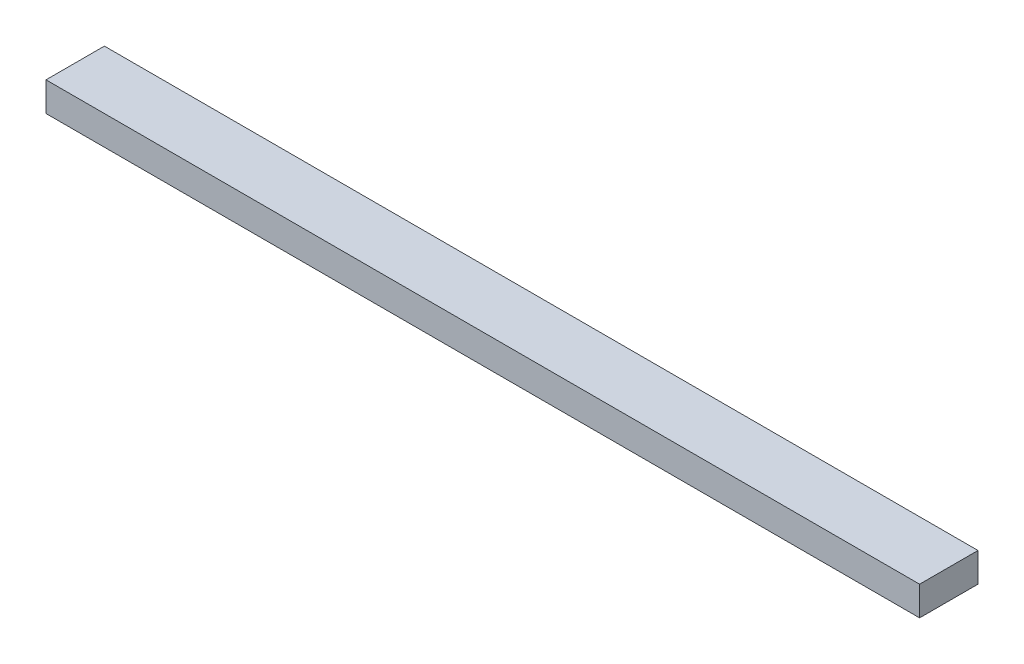
ISO-10303-21;
HEADER;
FILE_DESCRIPTION(('STEP AP214'),'2;1');
FILE_NAME('part.step','',(''),(''),'','','');
FILE_SCHEMA(('AUTOMOTIVE_DESIGN { 1 0 10303 214 1 1 1 1 }'));
ENDSEC;
DATA;
#1=APPLICATION_CONTEXT('core data for automotive mechanical design processes');
#2=APPLICATION_PROTOCOL_DEFINITION('international standard','automotive_design',2000,#1);
#3=PRODUCT_CONTEXT('',#1,'mechanical');
#4=PRODUCT('Part','Part','',(#3));
#5=PRODUCT_RELATED_PRODUCT_CATEGORY('part','',(#4));
#6=PRODUCT_DEFINITION_FORMATION('','',#4);
#7=PRODUCT_DEFINITION_CONTEXT('part definition',#1,'design');
#8=PRODUCT_DEFINITION('design','',#6,#7);
#9=PRODUCT_DEFINITION_SHAPE('','',#8);
#10=(LENGTH_UNIT() NAMED_UNIT(*) SI_UNIT(.MILLI.,.METRE.));
#11=(NAMED_UNIT(*) PLANE_ANGLE_UNIT() SI_UNIT($,.RADIAN.));
#12=(NAMED_UNIT(*) SI_UNIT($,.STERADIAN.) SOLID_ANGLE_UNIT());
#13=UNCERTAINTY_MEASURE_WITH_UNIT(LENGTH_MEASURE(1.E-05),#10,'distance_accuracy_value','');
#14=(GEOMETRIC_REPRESENTATION_CONTEXT(3) GLOBAL_UNCERTAINTY_ASSIGNED_CONTEXT((#13)) GLOBAL_UNIT_ASSIGNED_CONTEXT((#10,
#11,#12)) REPRESENTATION_CONTEXT('',''));
#15=CARTESIAN_POINT('',(0.,0.,0.));
#16=DIRECTION('',(0.,0.,1.));
#17=DIRECTION('',(1.,0.,0.));
#18=AXIS2_PLACEMENT_3D('',#15,#16,#17);
#19=CARTESIAN_POINT('',(0.,19.05,0.));
#20=DIRECTION('',(1.,0.,0.));
#21=DIRECTION('',(0.,0.,-1.));
#22=AXIS2_PLACEMENT_3D('',#19,#20,#21);
#23=PLANE('',#22);
#24=DIRECTION('',(0.,0.,1.));
#25=VECTOR('',#24,1.);
#26=CARTESIAN_POINT('',(0.,0.,0.));
#27=LINE('',#26,#25);
#28=CARTESIAN_POINT('',(0.,0.,-38.1));
#29=VERTEX_POINT('',#28);
#30=CARTESIAN_POINT('',(0.,0.,0.));
#31=VERTEX_POINT('',#30);
#32=EDGE_CURVE('E110',#29,#31,#27,.T.);
#33=ORIENTED_EDGE('',*,*,#32,.T.);
#34=DIRECTION('',(0.,-1.,0.));
#35=VECTOR('',#34,1.);
#36=CARTESIAN_POINT('',(0.,19.05,0.));
#37=LINE('',#36,#35);
#38=CARTESIAN_POINT('',(0.,19.05,0.));
#39=VERTEX_POINT('',#38);
#40=EDGE_CURVE('E11',#39,#31,#37,.T.);
#41=ORIENTED_EDGE('',*,*,#40,.F.);
#42=DIRECTION('',(0.,0.,1.));
#43=VECTOR('',#42,1.);
#44=CARTESIAN_POINT('',(0.,19.05,0.));
#45=LINE('',#44,#43);
#46=CARTESIAN_POINT('',(0.,19.05,-38.1));
#47=VERTEX_POINT('',#46);
#48=EDGE_CURVE('E93',#47,#39,#45,.T.);
#49=ORIENTED_EDGE('',*,*,#48,.F.);
#50=DIRECTION('',(0.,-1.,0.));
#51=VECTOR('',#50,1.);
#52=CARTESIAN_POINT('',(0.,19.05,-38.1));
#53=LINE('',#52,#51);
#54=EDGE_CURVE('E106',#47,#29,#53,.T.);
#55=ORIENTED_EDGE('',*,*,#54,.T.);
#56=EDGE_LOOP('',(#33,#41,#49,#55));
#57=FACE_BOUND('',#56,.T.);
#58=ADVANCED_FACE('F41',(#57),#23,.F.);
#59=CARTESIAN_POINT('',(0.,19.05,0.));
#60=DIRECTION('',(0.,0.,-1.));
#61=DIRECTION('',(-1.,0.,0.));
#62=AXIS2_PLACEMENT_3D('',#59,#60,#61);
#63=PLANE('',#62);
#64=DIRECTION('',(1.,0.,0.));
#65=VECTOR('',#64,1.);
#66=CARTESIAN_POINT('',(0.,0.,0.));
#67=LINE('',#66,#65);
#68=CARTESIAN_POINT('',(569.9125,0.,0.));
#69=VERTEX_POINT('',#68);
#70=EDGE_CURVE('E98',#31,#69,#67,.T.);
#71=ORIENTED_EDGE('',*,*,#70,.T.);
#72=DIRECTION('',(0.,-1.,0.));
#73=VECTOR('',#72,1.);
#74=CARTESIAN_POINT('',(569.9125,19.05,0.));
#75=LINE('',#74,#73);
#76=CARTESIAN_POINT('',(569.9125,19.05,0.));
#77=VERTEX_POINT('',#76);
#78=EDGE_CURVE('E50',#77,#69,#75,.T.);
#79=ORIENTED_EDGE('',*,*,#78,.F.);
#80=DIRECTION('',(1.,0.,0.));
#81=VECTOR('',#80,1.);
#82=CARTESIAN_POINT('',(0.,19.05,0.));
#83=LINE('',#82,#81);
#84=EDGE_CURVE('E88',#39,#77,#83,.T.);
#85=ORIENTED_EDGE('',*,*,#84,.F.);
#86=ORIENTED_EDGE('',*,*,#40,.T.);
#87=EDGE_LOOP('',(#71,#79,#85,#86));
#88=FACE_BOUND('',#87,.T.);
#89=ADVANCED_FACE('F97',(#88),#63,.F.);
#90=CARTESIAN_POINT('',(569.9125,19.05,0.));
#91=DIRECTION('',(-1.,0.,0.));
#92=DIRECTION('',(0.,0.,1.));
#93=AXIS2_PLACEMENT_3D('',#90,#91,#92);
#94=PLANE('',#93);
#95=DIRECTION('',(0.,0.,-1.));
#96=VECTOR('',#95,1.);
#97=CARTESIAN_POINT('',(569.9125,0.,0.));
#98=LINE('',#97,#96);
#99=CARTESIAN_POINT('',(569.9125,0.,-38.1));
#100=VERTEX_POINT('',#99);
#101=EDGE_CURVE('E75',#69,#100,#98,.T.);
#102=ORIENTED_EDGE('',*,*,#101,.T.);
#103=DIRECTION('',(0.,-1.,0.));
#104=VECTOR('',#103,1.);
#105=CARTESIAN_POINT('',(569.9125,19.05,-38.1));
#106=LINE('',#105,#104);
#107=CARTESIAN_POINT('',(569.9125,19.05,-38.1));
#108=VERTEX_POINT('',#107);
#109=EDGE_CURVE('E100',#108,#100,#106,.T.);
#110=ORIENTED_EDGE('',*,*,#109,.F.);
#111=DIRECTION('',(0.,0.,-1.));
#112=VECTOR('',#111,1.);
#113=CARTESIAN_POINT('',(569.9125,19.05,0.));
#114=LINE('',#113,#112);
#115=EDGE_CURVE('E91',#77,#108,#114,.T.);
#116=ORIENTED_EDGE('',*,*,#115,.F.);
#117=ORIENTED_EDGE('',*,*,#78,.T.);
#118=EDGE_LOOP('',(#102,#110,#116,#117));
#119=FACE_BOUND('',#118,.T.);
#120=ADVANCED_FACE('F101',(#119),#94,.F.);
#121=CARTESIAN_POINT('',(0.,19.05,-38.1));
#122=DIRECTION('',(0.,0.,1.));
#123=DIRECTION('',(1.,0.,0.));
#124=AXIS2_PLACEMENT_3D('',#121,#122,#123);
#125=PLANE('',#124);
#126=DIRECTION('',(-1.,0.,0.));
#127=VECTOR('',#126,1.);
#128=CARTESIAN_POINT('',(0.,0.,-38.1));
#129=LINE('',#128,#127);
#130=EDGE_CURVE('E81',#100,#29,#129,.T.);
#131=ORIENTED_EDGE('',*,*,#130,.T.);
#132=ORIENTED_EDGE('',*,*,#54,.F.);
#133=DIRECTION('',(-1.,0.,0.));
#134=VECTOR('',#133,1.);
#135=CARTESIAN_POINT('',(0.,19.05,-38.1));
#136=LINE('',#135,#134);
#137=EDGE_CURVE('E58',#108,#47,#136,.T.);
#138=ORIENTED_EDGE('',*,*,#137,.F.);
#139=ORIENTED_EDGE('',*,*,#109,.T.);
#140=EDGE_LOOP('',(#131,#132,#138,#139));
#141=FACE_BOUND('',#140,.T.);
#142=ADVANCED_FACE('F124',(#141),#125,.F.);
#143=CARTESIAN_POINT('',(0.,19.05,0.));
#144=DIRECTION('',(0.,-1.,0.));
#145=DIRECTION('',(0.,0.,-1.));
#146=AXIS2_PLACEMENT_3D('',#143,#144,#145);
#147=PLANE('',#146);
#148=ORIENTED_EDGE('',*,*,#48,.T.);
#149=ORIENTED_EDGE('',*,*,#84,.T.);
#150=ORIENTED_EDGE('',*,*,#115,.T.);
#151=ORIENTED_EDGE('',*,*,#137,.T.);
#152=EDGE_LOOP('',(#148,#149,#150,#151));
#153=FACE_BOUND('',#152,.T.);
#154=ADVANCED_FACE('F89',(#153),#147,.F.);
#155=CARTESIAN_POINT('',(0.,0.,0.));
#156=DIRECTION('',(0.,-1.,0.));
#157=DIRECTION('',(0.,0.,-1.));
#158=AXIS2_PLACEMENT_3D('',#155,#156,#157);
#159=PLANE('',#158);
#160=ORIENTED_EDGE('',*,*,#32,.F.);
#161=ORIENTED_EDGE('',*,*,#130,.F.);
#162=ORIENTED_EDGE('',*,*,#101,.F.);
#163=ORIENTED_EDGE('',*,*,#70,.F.);
#164=EDGE_LOOP('',(#160,#161,#162,#163));
#165=FACE_BOUND('',#164,.T.);
#166=ADVANCED_FACE('F127',(#165),#159,.T.);
#167=CLOSED_SHELL('',(#58,#89,#120,#142,#154,#166));
#168=MANIFOLD_SOLID_BREP('B2',#167);
#169=ADVANCED_BREP_SHAPE_REPRESENTATION('',(#18,#168),#14);
#170=SHAPE_DEFINITION_REPRESENTATION(#9,#169);
ENDSEC;
END-ISO-10303-21;
